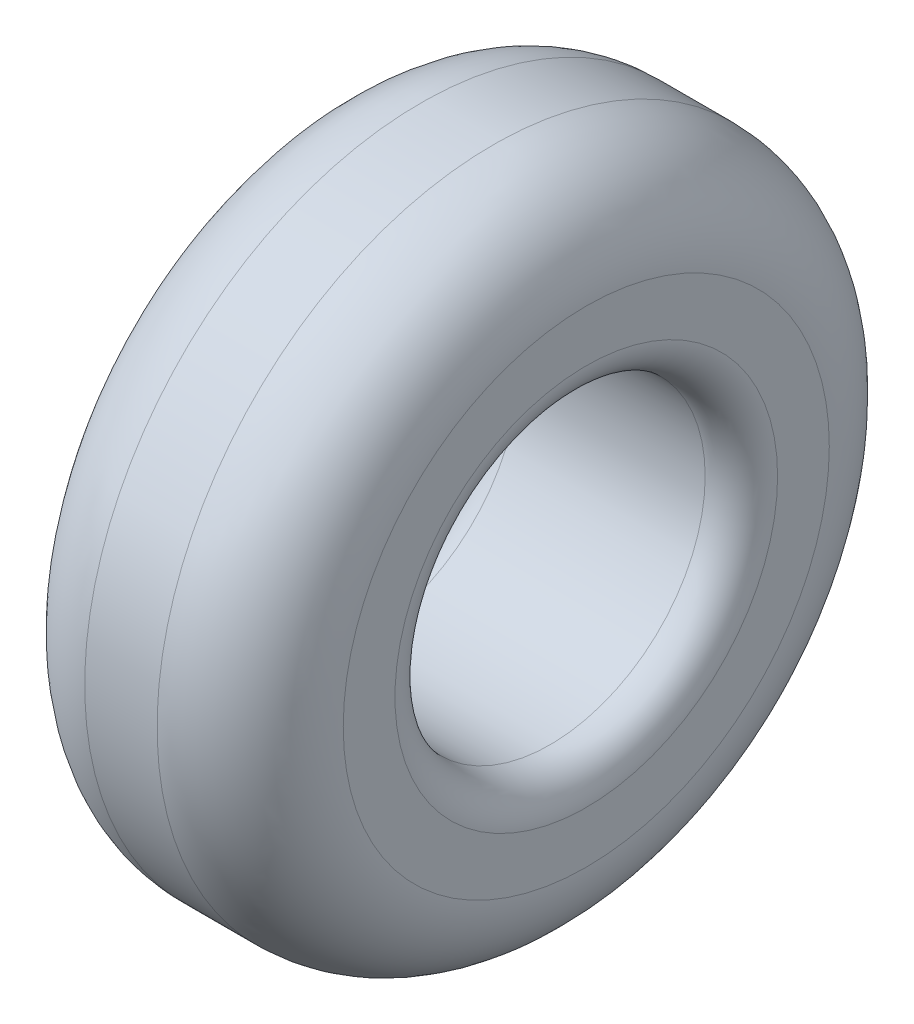
ISO-10303-21;
HEADER;
FILE_DESCRIPTION(('STEP AP214'),'2;1');
FILE_NAME('part.step','',(''),(''),'','','');
FILE_SCHEMA(('AUTOMOTIVE_DESIGN { 1 0 10303 214 1 1 1 1 }'));
ENDSEC;
DATA;
#1=APPLICATION_CONTEXT('core data for automotive mechanical design processes');
#2=APPLICATION_PROTOCOL_DEFINITION('international standard','automotive_design',2000,#1);
#3=PRODUCT_CONTEXT('',#1,'mechanical');
#4=PRODUCT('Part','Part','',(#3));
#5=PRODUCT_RELATED_PRODUCT_CATEGORY('part','',(#4));
#6=PRODUCT_DEFINITION_FORMATION('','',#4);
#7=PRODUCT_DEFINITION_CONTEXT('part definition',#1,'design');
#8=PRODUCT_DEFINITION('design','',#6,#7);
#9=PRODUCT_DEFINITION_SHAPE('','',#8);
#10=(LENGTH_UNIT() NAMED_UNIT(*) SI_UNIT(.MILLI.,.METRE.));
#11=(NAMED_UNIT(*) PLANE_ANGLE_UNIT() SI_UNIT($,.RADIAN.));
#12=(NAMED_UNIT(*) SI_UNIT($,.STERADIAN.) SOLID_ANGLE_UNIT());
#13=UNCERTAINTY_MEASURE_WITH_UNIT(LENGTH_MEASURE(1.E-05),#10,'distance_accuracy_value','');
#14=(GEOMETRIC_REPRESENTATION_CONTEXT(3) GLOBAL_UNCERTAINTY_ASSIGNED_CONTEXT((#13)) GLOBAL_UNIT_ASSIGNED_CONTEXT((#10,
#11,#12)) REPRESENTATION_CONTEXT('',''));
#15=CARTESIAN_POINT('',(0.,0.,0.));
#16=DIRECTION('',(0.,0.,1.));
#17=DIRECTION('',(1.,0.,0.));
#18=AXIS2_PLACEMENT_3D('',#15,#16,#17);
#19=CARTESIAN_POINT('',(127.,0.,0.));
#20=DIRECTION('',(-1.,0.,0.));
#21=DIRECTION('',(0.,0.,1.));
#22=AXIS2_PLACEMENT_3D('',#19,#20,#21);
#23=CYLINDRICAL_SURFACE('',#22,165.1);
#24=CARTESIAN_POINT('',(45.72,0.,0.));
#25=DIRECTION('',(1.,0.,0.));
#26=DIRECTION('',(0.,0.,-1.));
#27=AXIS2_PLACEMENT_3D('',#24,#25,#26);
#28=CIRCLE('',#27,165.1);
#29=CARTESIAN_POINT('',(45.72,0.,-165.1));
#30=VERTEX_POINT('',#29);
#31=EDGE_CURVE('E42',#30,#30,#28,.T.);
#32=ORIENTED_EDGE('',*,*,#31,.T.);
#33=EDGE_LOOP('',(#32));
#34=FACE_BOUND('',#33,.T.);
#35=CARTESIAN_POINT('',(81.28,0.,0.));
#36=DIRECTION('',(1.,0.,0.));
#37=DIRECTION('',(0.,0.,-1.));
#38=AXIS2_PLACEMENT_3D('',#35,#36,#37);
#39=CIRCLE('',#38,165.1);
#40=CARTESIAN_POINT('',(81.28,0.,-165.1));
#41=VERTEX_POINT('',#40);
#42=EDGE_CURVE('E46',#41,#41,#39,.F.);
#43=ORIENTED_EDGE('',*,*,#42,.T.);
#44=EDGE_LOOP('',(#43));
#45=FACE_BOUND('',#44,.T.);
#46=ADVANCED_FACE('F31',(#34,#45),#23,.T.);
#47=CARTESIAN_POINT('',(127.,0.,0.));
#48=DIRECTION('',(1.,0.,0.));
#49=DIRECTION('',(0.,0.,-1.));
#50=AXIS2_PLACEMENT_3D('',#47,#48,#49);
#51=PLANE('',#50);
#52=CARTESIAN_POINT('',(127.,0.,0.));
#53=DIRECTION('',(1.,0.,0.));
#54=DIRECTION('',(0.,0.,-1.));
#55=AXIS2_PLACEMENT_3D('',#52,#53,#54);
#56=CIRCLE('',#55,119.38);
#57=CARTESIAN_POINT('',(127.,0.,-119.38));
#58=VERTEX_POINT('',#57);
#59=EDGE_CURVE('E10',#58,#58,#56,.T.);
#60=ORIENTED_EDGE('',*,*,#59,.T.);
#61=EDGE_LOOP('',(#60));
#62=FACE_BOUND('',#61,.T.);
#63=CARTESIAN_POINT('',(127.,0.,0.));
#64=DIRECTION('',(1.,0.,0.));
#65=DIRECTION('',(0.,0.,-1.));
#66=AXIS2_PLACEMENT_3D('',#63,#64,#65);
#67=CIRCLE('',#66,93.98);
#68=CARTESIAN_POINT('',(127.,0.,-93.98));
#69=VERTEX_POINT('',#68);
#70=EDGE_CURVE('E54',#69,#69,#67,.F.);
#71=ORIENTED_EDGE('',*,*,#70,.T.);
#72=EDGE_LOOP('',(#71));
#73=FACE_BOUND('',#72,.T.);
#74=ADVANCED_FACE('F76',(#62,#73),#51,.T.);
#75=CARTESIAN_POINT('',(0.,0.,0.));
#76=DIRECTION('',(1.,0.,0.));
#77=DIRECTION('',(0.,0.,-1.));
#78=AXIS2_PLACEMENT_3D('',#75,#76,#77);
#79=PLANE('',#78);
#80=CARTESIAN_POINT('',(0.,0.,0.));
#81=DIRECTION('',(1.,0.,0.));
#82=DIRECTION('',(0.,0.,-1.));
#83=AXIS2_PLACEMENT_3D('',#80,#81,#82);
#84=CIRCLE('',#83,119.38);
#85=CARTESIAN_POINT('',(0.,0.,-119.38));
#86=VERTEX_POINT('',#85);
#87=EDGE_CURVE('E38',#86,#86,#84,.F.);
#88=ORIENTED_EDGE('',*,*,#87,.T.);
#89=EDGE_LOOP('',(#88));
#90=FACE_BOUND('',#89,.T.);
#91=CARTESIAN_POINT('',(0.,0.,0.));
#92=DIRECTION('',(1.,0.,0.));
#93=DIRECTION('',(0.,0.,-1.));
#94=AXIS2_PLACEMENT_3D('',#91,#92,#93);
#95=CIRCLE('',#94,93.98);
#96=CARTESIAN_POINT('',(0.,0.,-93.98));
#97=VERTEX_POINT('',#96);
#98=EDGE_CURVE('E51',#97,#97,#95,.T.);
#99=ORIENTED_EDGE('',*,*,#98,.T.);
#100=EDGE_LOOP('',(#99));
#101=FACE_BOUND('',#100,.T.);
#102=ADVANCED_FACE('F74',(#90,#101),#79,.F.);
#103=CARTESIAN_POINT('',(0.,0.,0.));
#104=DIRECTION('',(1.,0.,0.));
#105=DIRECTION('',(0.,0.,-1.));
#106=AXIS2_PLACEMENT_3D('',#103,#104,#105);
#107=CYLINDRICAL_SURFACE('',#106,76.2);
#108=CARTESIAN_POINT('',(109.22,0.,0.));
#109=DIRECTION('',(1.,0.,0.));
#110=DIRECTION('',(0.,0.,-1.));
#111=AXIS2_PLACEMENT_3D('',#108,#109,#110);
#112=CIRCLE('',#111,76.2);
#113=CARTESIAN_POINT('',(109.22,0.,-76.2));
#114=VERTEX_POINT('',#113);
#115=EDGE_CURVE('E57',#114,#114,#112,.T.);
#116=ORIENTED_EDGE('',*,*,#115,.T.);
#117=EDGE_LOOP('',(#116));
#118=FACE_BOUND('',#117,.T.);
#119=CARTESIAN_POINT('',(17.78,0.,0.));
#120=DIRECTION('',(1.,0.,0.));
#121=DIRECTION('',(0.,0.,-1.));
#122=AXIS2_PLACEMENT_3D('',#119,#120,#121);
#123=CIRCLE('',#122,76.2);
#124=CARTESIAN_POINT('',(17.78,0.,-76.2));
#125=VERTEX_POINT('',#124);
#126=EDGE_CURVE('E60',#125,#125,#123,.F.);
#127=ORIENTED_EDGE('',*,*,#126,.T.);
#128=EDGE_LOOP('',(#127));
#129=FACE_BOUND('',#128,.T.);
#130=ADVANCED_FACE('F64',(#118,#129),#107,.F.);
#131=CARTESIAN_POINT('',(109.22,0.,0.));
#132=DIRECTION('',(1.,0.,0.));
#133=DIRECTION('',(0.,0.,-1.));
#134=AXIS2_PLACEMENT_3D('',#131,#132,#133);
#135=TOROIDAL_SURFACE('',#134,93.98,17.78);
#136=ORIENTED_EDGE('',*,*,#70,.F.);
#137=EDGE_LOOP('',(#136));
#138=FACE_BOUND('',#137,.T.);
#139=ORIENTED_EDGE('',*,*,#115,.F.);
#140=EDGE_LOOP('',(#139));
#141=FACE_BOUND('',#140,.T.);
#142=ADVANCED_FACE('F70',(#138,#141),#135,.T.);
#143=CARTESIAN_POINT('',(17.78,0.,0.));
#144=DIRECTION('',(1.,0.,0.));
#145=DIRECTION('',(0.,0.,-1.));
#146=AXIS2_PLACEMENT_3D('',#143,#144,#145);
#147=TOROIDAL_SURFACE('',#146,93.98,17.78);
#148=ORIENTED_EDGE('',*,*,#126,.F.);
#149=EDGE_LOOP('',(#148));
#150=FACE_BOUND('',#149,.T.);
#151=ORIENTED_EDGE('',*,*,#98,.F.);
#152=EDGE_LOOP('',(#151));
#153=FACE_BOUND('',#152,.T.);
#154=ADVANCED_FACE('F66',(#150,#153),#147,.T.);
#155=CARTESIAN_POINT('',(45.72,0.,0.));
#156=DIRECTION('',(1.,0.,0.));
#157=DIRECTION('',(0.,0.,-1.));
#158=AXIS2_PLACEMENT_3D('',#155,#156,#157);
#159=TOROIDAL_SURFACE('',#158,119.38,45.72);
#160=ORIENTED_EDGE('',*,*,#87,.F.);
#161=EDGE_LOOP('',(#160));
#162=FACE_BOUND('',#161,.T.);
#163=ORIENTED_EDGE('',*,*,#31,.F.);
#164=EDGE_LOOP('',(#163));
#165=FACE_BOUND('',#164,.T.);
#166=ADVANCED_FACE('F69',(#162,#165),#159,.T.);
#167=CARTESIAN_POINT('',(81.28,0.,0.));
#168=DIRECTION('',(1.,0.,0.));
#169=DIRECTION('',(0.,0.,-1.));
#170=AXIS2_PLACEMENT_3D('',#167,#168,#169);
#171=TOROIDAL_SURFACE('',#170,119.38,45.72);
#172=ORIENTED_EDGE('',*,*,#42,.F.);
#173=EDGE_LOOP('',(#172));
#174=FACE_BOUND('',#173,.T.);
#175=ORIENTED_EDGE('',*,*,#59,.F.);
#176=EDGE_LOOP('',(#175));
#177=FACE_BOUND('',#176,.T.);
#178=ADVANCED_FACE('F33',(#174,#177),#171,.T.);
#179=CLOSED_SHELL('',(#46,#74,#102,#130,#142,#154,#166,#178));
#180=MANIFOLD_SOLID_BREP('B2',#179);
#181=ADVANCED_BREP_SHAPE_REPRESENTATION('',(#18,#180),#14);
#182=SHAPE_DEFINITION_REPRESENTATION(#9,#181);
ENDSEC;
END-ISO-10303-21;
